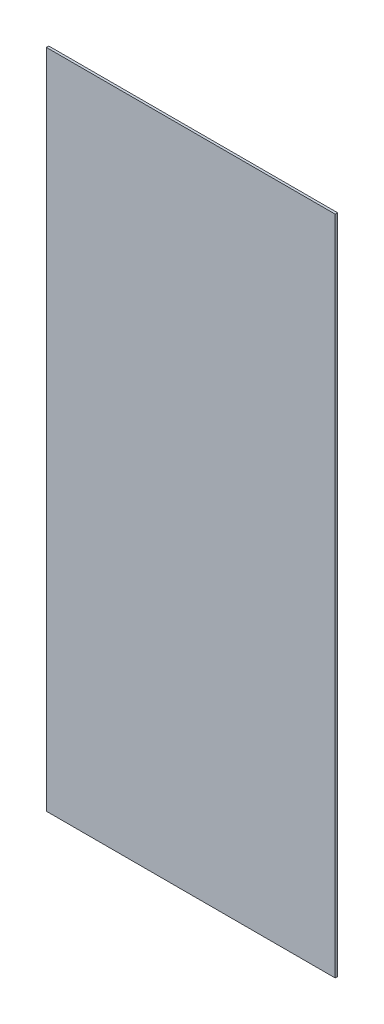
ISO-10303-21;
HEADER;
FILE_DESCRIPTION(('STEP AP214'),'2;1');
FILE_NAME('part.step','',(''),(''),'','','');
FILE_SCHEMA(('AUTOMOTIVE_DESIGN { 1 0 10303 214 1 1 1 1 }'));
ENDSEC;
DATA;
#1=APPLICATION_CONTEXT('core data for automotive mechanical design processes');
#2=APPLICATION_PROTOCOL_DEFINITION('international standard','automotive_design',2000,#1);
#3=PRODUCT_CONTEXT('',#1,'mechanical');
#4=PRODUCT('Part','Part','',(#3));
#5=PRODUCT_RELATED_PRODUCT_CATEGORY('part','',(#4));
#6=PRODUCT_DEFINITION_FORMATION('','',#4);
#7=PRODUCT_DEFINITION_CONTEXT('part definition',#1,'design');
#8=PRODUCT_DEFINITION('design','',#6,#7);
#9=PRODUCT_DEFINITION_SHAPE('','',#8);
#10=(LENGTH_UNIT() NAMED_UNIT(*) SI_UNIT(.MILLI.,.METRE.));
#11=(NAMED_UNIT(*) PLANE_ANGLE_UNIT() SI_UNIT($,.RADIAN.));
#12=(NAMED_UNIT(*) SI_UNIT($,.STERADIAN.) SOLID_ANGLE_UNIT());
#13=UNCERTAINTY_MEASURE_WITH_UNIT(LENGTH_MEASURE(1.E-05),#10,'distance_accuracy_value','');
#14=(GEOMETRIC_REPRESENTATION_CONTEXT(3) GLOBAL_UNCERTAINTY_ASSIGNED_CONTEXT((#13)) GLOBAL_UNIT_ASSIGNED_CONTEXT((#10,
#11,#12)) REPRESENTATION_CONTEXT('',''));
#15=CARTESIAN_POINT('',(0.,0.,0.));
#16=DIRECTION('',(0.,0.,1.));
#17=DIRECTION('',(1.,0.,0.));
#18=AXIS2_PLACEMENT_3D('',#15,#16,#17);
#19=CARTESIAN_POINT('',(0.,0.,3.));
#20=DIRECTION('',(1.,0.,0.));
#21=DIRECTION('',(0.,0.,-1.));
#22=AXIS2_PLACEMENT_3D('',#19,#20,#21);
#23=PLANE('',#22);
#24=DIRECTION('',(0.,-1.,0.));
#25=VECTOR('',#24,1.);
#26=CARTESIAN_POINT('',(0.,0.,0.));
#27=LINE('',#26,#25);
#28=CARTESIAN_POINT('',(0.,820.,0.));
#29=VERTEX_POINT('',#28);
#30=CARTESIAN_POINT('',(0.,0.,0.));
#31=VERTEX_POINT('',#30);
#32=EDGE_CURVE('E96',#29,#31,#27,.T.);
#33=ORIENTED_EDGE('',*,*,#32,.T.);
#34=DIRECTION('',(0.,0.,-1.));
#35=VECTOR('',#34,1.);
#36=CARTESIAN_POINT('',(0.,0.,3.));
#37=LINE('',#36,#35);
#38=CARTESIAN_POINT('',(0.,0.,3.));
#39=VERTEX_POINT('',#38);
#40=EDGE_CURVE('E11',#39,#31,#37,.T.);
#41=ORIENTED_EDGE('',*,*,#40,.F.);
#42=DIRECTION('',(0.,-1.,0.));
#43=VECTOR('',#42,1.);
#44=CARTESIAN_POINT('',(0.,0.,3.));
#45=LINE('',#44,#43);
#46=CARTESIAN_POINT('',(0.,820.,3.));
#47=VERTEX_POINT('',#46);
#48=EDGE_CURVE('E84',#47,#39,#45,.T.);
#49=ORIENTED_EDGE('',*,*,#48,.F.);
#50=DIRECTION('',(0.,0.,-1.));
#51=VECTOR('',#50,1.);
#52=CARTESIAN_POINT('',(0.,820.,3.));
#53=LINE('',#52,#51);
#54=EDGE_CURVE('E92',#47,#29,#53,.T.);
#55=ORIENTED_EDGE('',*,*,#54,.T.);
#56=EDGE_LOOP('',(#33,#41,#49,#55));
#57=FACE_BOUND('',#56,.T.);
#58=ADVANCED_FACE('F33',(#57),#23,.F.);
#59=CARTESIAN_POINT('',(0.,0.,3.));
#60=DIRECTION('',(0.,1.,0.));
#61=DIRECTION('',(0.,0.,1.));
#62=AXIS2_PLACEMENT_3D('',#59,#60,#61);
#63=PLANE('',#62);
#64=DIRECTION('',(1.,0.,0.));
#65=VECTOR('',#64,1.);
#66=CARTESIAN_POINT('',(0.,0.,0.));
#67=LINE('',#66,#65);
#68=CARTESIAN_POINT('',(358.,0.,0.));
#69=VERTEX_POINT('',#68);
#70=EDGE_CURVE('E88',#31,#69,#67,.T.);
#71=ORIENTED_EDGE('',*,*,#70,.T.);
#72=DIRECTION('',(0.,0.,-1.));
#73=VECTOR('',#72,1.);
#74=CARTESIAN_POINT('',(358.,0.,3.));
#75=LINE('',#74,#73);
#76=CARTESIAN_POINT('',(358.,0.,3.));
#77=VERTEX_POINT('',#76);
#78=EDGE_CURVE('E41',#77,#69,#75,.T.);
#79=ORIENTED_EDGE('',*,*,#78,.F.);
#80=DIRECTION('',(1.,0.,0.));
#81=VECTOR('',#80,1.);
#82=CARTESIAN_POINT('',(0.,0.,3.));
#83=LINE('',#82,#81);
#84=EDGE_CURVE('E79',#39,#77,#83,.T.);
#85=ORIENTED_EDGE('',*,*,#84,.F.);
#86=ORIENTED_EDGE('',*,*,#40,.T.);
#87=EDGE_LOOP('',(#71,#79,#85,#86));
#88=FACE_BOUND('',#87,.T.);
#89=ADVANCED_FACE('F87',(#88),#63,.F.);
#90=CARTESIAN_POINT('',(358.,0.,3.));
#91=DIRECTION('',(-1.,0.,0.));
#92=DIRECTION('',(0.,0.,1.));
#93=AXIS2_PLACEMENT_3D('',#90,#91,#92);
#94=PLANE('',#93);
#95=DIRECTION('',(0.,1.,0.));
#96=VECTOR('',#95,1.);
#97=CARTESIAN_POINT('',(358.,0.,0.));
#98=LINE('',#97,#96);
#99=CARTESIAN_POINT('',(358.,820.,0.));
#100=VERTEX_POINT('',#99);
#101=EDGE_CURVE('E66',#69,#100,#98,.T.);
#102=ORIENTED_EDGE('',*,*,#101,.T.);
#103=DIRECTION('',(0.,0.,-1.));
#104=VECTOR('',#103,1.);
#105=CARTESIAN_POINT('',(358.,820.,3.));
#106=LINE('',#105,#104);
#107=CARTESIAN_POINT('',(358.,820.,3.));
#108=VERTEX_POINT('',#107);
#109=EDGE_CURVE('E89',#108,#100,#106,.T.);
#110=ORIENTED_EDGE('',*,*,#109,.F.);
#111=DIRECTION('',(0.,1.,0.));
#112=VECTOR('',#111,1.);
#113=CARTESIAN_POINT('',(358.,0.,3.));
#114=LINE('',#113,#112);
#115=EDGE_CURVE('E82',#77,#108,#114,.T.);
#116=ORIENTED_EDGE('',*,*,#115,.F.);
#117=ORIENTED_EDGE('',*,*,#78,.T.);
#118=EDGE_LOOP('',(#102,#110,#116,#117));
#119=FACE_BOUND('',#118,.T.);
#120=ADVANCED_FACE('F90',(#119),#94,.F.);
#121=CARTESIAN_POINT('',(0.,820.,3.));
#122=DIRECTION('',(0.,-1.,0.));
#123=DIRECTION('',(0.,0.,-1.));
#124=AXIS2_PLACEMENT_3D('',#121,#122,#123);
#125=PLANE('',#124);
#126=DIRECTION('',(-1.,0.,0.));
#127=VECTOR('',#126,1.);
#128=CARTESIAN_POINT('',(0.,820.,0.));
#129=LINE('',#128,#127);
#130=EDGE_CURVE('E72',#100,#29,#129,.T.);
#131=ORIENTED_EDGE('',*,*,#130,.T.);
#132=ORIENTED_EDGE('',*,*,#54,.F.);
#133=DIRECTION('',(-1.,0.,0.));
#134=VECTOR('',#133,1.);
#135=CARTESIAN_POINT('',(0.,820.,3.));
#136=LINE('',#135,#134);
#137=EDGE_CURVE('E49',#108,#47,#136,.T.);
#138=ORIENTED_EDGE('',*,*,#137,.F.);
#139=ORIENTED_EDGE('',*,*,#109,.T.);
#140=EDGE_LOOP('',(#131,#132,#138,#139));
#141=FACE_BOUND('',#140,.T.);
#142=ADVANCED_FACE('F103',(#141),#125,.F.);
#143=CARTESIAN_POINT('',(0.,0.,3.));
#144=DIRECTION('',(0.,0.,-1.));
#145=DIRECTION('',(-1.,0.,0.));
#146=AXIS2_PLACEMENT_3D('',#143,#144,#145);
#147=PLANE('',#146);
#148=ORIENTED_EDGE('',*,*,#48,.T.);
#149=ORIENTED_EDGE('',*,*,#84,.T.);
#150=ORIENTED_EDGE('',*,*,#115,.T.);
#151=ORIENTED_EDGE('',*,*,#137,.T.);
#152=EDGE_LOOP('',(#148,#149,#150,#151));
#153=FACE_BOUND('',#152,.T.);
#154=ADVANCED_FACE('F80',(#153),#147,.F.);
#155=CARTESIAN_POINT('',(0.,0.,0.));
#156=DIRECTION('',(0.,0.,-1.));
#157=DIRECTION('',(-1.,0.,0.));
#158=AXIS2_PLACEMENT_3D('',#155,#156,#157);
#159=PLANE('',#158);
#160=ORIENTED_EDGE('',*,*,#32,.F.);
#161=ORIENTED_EDGE('',*,*,#130,.F.);
#162=ORIENTED_EDGE('',*,*,#101,.F.);
#163=ORIENTED_EDGE('',*,*,#70,.F.);
#164=EDGE_LOOP('',(#160,#161,#162,#163));
#165=FACE_BOUND('',#164,.T.);
#166=ADVANCED_FACE('F106',(#165),#159,.T.);
#167=CLOSED_SHELL('',(#58,#89,#120,#142,#154,#166));
#168=MANIFOLD_SOLID_BREP('B2',#167);
#169=ADVANCED_BREP_SHAPE_REPRESENTATION('',(#18,#168),#14);
#170=SHAPE_DEFINITION_REPRESENTATION(#9,#169);
ENDSEC;
END-ISO-10303-21;
